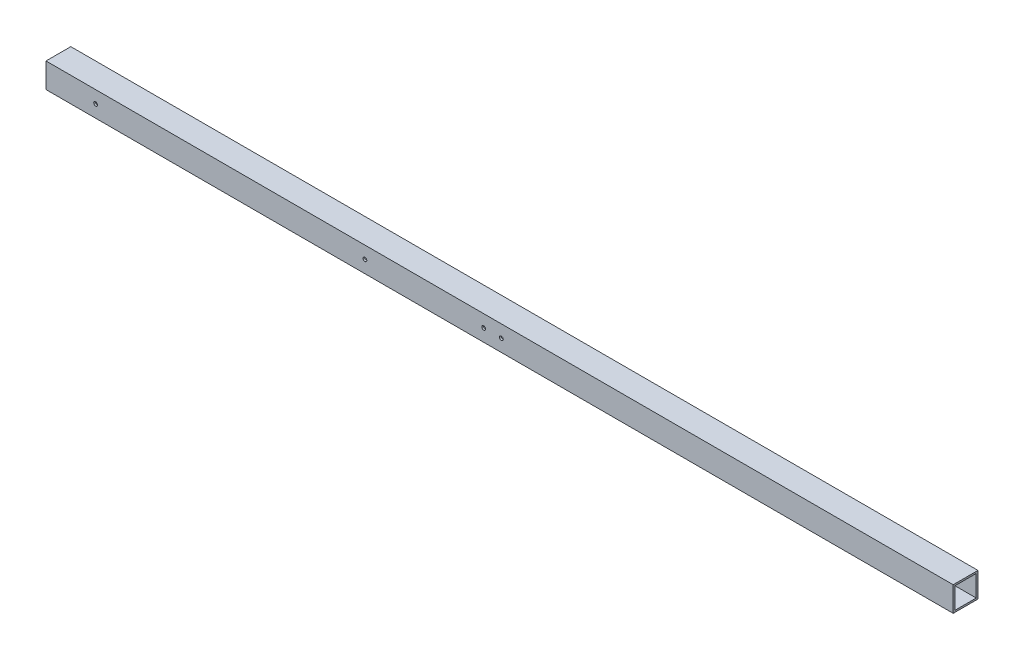
ISO-10303-21;
HEADER;
FILE_DESCRIPTION(('STEP AP214'),'2;1');
FILE_NAME('part.step','',(''),(''),'','','');
FILE_SCHEMA(('AUTOMOTIVE_DESIGN { 1 0 10303 214 1 1 1 1 }'));
ENDSEC;
DATA;
#1=APPLICATION_CONTEXT('core data for automotive mechanical design processes');
#2=APPLICATION_PROTOCOL_DEFINITION('international standard','automotive_design',2000,#1);
#3=PRODUCT_CONTEXT('',#1,'mechanical');
#4=PRODUCT('Part','Part','',(#3));
#5=PRODUCT_RELATED_PRODUCT_CATEGORY('part','',(#4));
#6=PRODUCT_DEFINITION_FORMATION('','',#4);
#7=PRODUCT_DEFINITION_CONTEXT('part definition',#1,'design');
#8=PRODUCT_DEFINITION('design','',#6,#7);
#9=PRODUCT_DEFINITION_SHAPE('','',#8);
#10=(LENGTH_UNIT() NAMED_UNIT(*) SI_UNIT(.MILLI.,.METRE.));
#11=(NAMED_UNIT(*) PLANE_ANGLE_UNIT() SI_UNIT($,.RADIAN.));
#12=(NAMED_UNIT(*) SI_UNIT($,.STERADIAN.) SOLID_ANGLE_UNIT());
#13=UNCERTAINTY_MEASURE_WITH_UNIT(LENGTH_MEASURE(1.E-05),#10,'distance_accuracy_value','');
#14=(GEOMETRIC_REPRESENTATION_CONTEXT(3) GLOBAL_UNCERTAINTY_ASSIGNED_CONTEXT((#13)) GLOBAL_UNIT_ASSIGNED_CONTEXT((#10,
#11,#12)) REPRESENTATION_CONTEXT('',''));
#15=CARTESIAN_POINT('',(0.,0.,0.));
#16=DIRECTION('',(0.,0.,1.));
#17=DIRECTION('',(1.,0.,0.));
#18=AXIS2_PLACEMENT_3D('',#15,#16,#17);
#19=CARTESIAN_POINT('',(1625.6,0.,0.));
#20=DIRECTION('',(-1.,0.,0.));
#21=DIRECTION('',(0.,0.,1.));
#22=AXIS2_PLACEMENT_3D('',#19,#20,#21);
#23=PLANE('',#22);
#24=DIRECTION('',(0.,-1.,0.));
#25=VECTOR('',#24,1.);
#26=CARTESIAN_POINT('',(1625.6,0.,0.));
#27=LINE('',#26,#25);
#28=CARTESIAN_POINT('',(1625.6,44.45,0.));
#29=VERTEX_POINT('',#28);
#30=CARTESIAN_POINT('',(1625.6,0.,0.));
#31=VERTEX_POINT('',#30);
#32=EDGE_CURVE('E142',#29,#31,#27,.T.);
#33=ORIENTED_EDGE('',*,*,#32,.T.);
#34=DIRECTION('',(0.,0.,-1.));
#35=VECTOR('',#34,1.);
#36=CARTESIAN_POINT('',(1625.6,0.,0.));
#37=LINE('',#36,#35);
#38=CARTESIAN_POINT('',(1625.6,0.,-44.45));
#39=VERTEX_POINT('',#38);
#40=EDGE_CURVE('E145',#31,#39,#37,.T.);
#41=ORIENTED_EDGE('',*,*,#40,.T.);
#42=DIRECTION('',(0.,1.,0.));
#43=VECTOR('',#42,1.);
#44=CARTESIAN_POINT('',(1625.6,0.,-44.45));
#45=LINE('',#44,#43);
#46=CARTESIAN_POINT('',(1625.6,44.45,-44.45));
#47=VERTEX_POINT('',#46);
#48=EDGE_CURVE('E148',#39,#47,#45,.T.);
#49=ORIENTED_EDGE('',*,*,#48,.T.);
#50=DIRECTION('',(0.,0.,1.));
#51=VECTOR('',#50,1.);
#52=CARTESIAN_POINT('',(1625.6,44.45,0.));
#53=LINE('',#52,#51);
#54=EDGE_CURVE('E150',#47,#29,#53,.T.);
#55=ORIENTED_EDGE('',*,*,#54,.T.);
#56=EDGE_LOOP('',(#33,#41,#49,#55));
#57=FACE_BOUND('',#56,.T.);
#58=DIRECTION('',(0.,-1.,0.));
#59=VECTOR('',#58,1.);
#60=CARTESIAN_POINT('',(1625.6,41.275,-3.175));
#61=LINE('',#60,#59);
#62=CARTESIAN_POINT('',(1625.6,41.275,-3.175));
#63=VERTEX_POINT('',#62);
#64=CARTESIAN_POINT('',(1625.6,3.175,-3.175));
#65=VERTEX_POINT('',#64);
#66=EDGE_CURVE('E104',#63,#65,#61,.T.);
#67=ORIENTED_EDGE('',*,*,#66,.F.);
#68=DIRECTION('',(0.,0.,1.));
#69=VECTOR('',#68,1.);
#70=CARTESIAN_POINT('',(1625.6,41.275,-3.175));
#71=LINE('',#70,#69);
#72=CARTESIAN_POINT('',(1625.6,41.275,-41.275));
#73=VERTEX_POINT('',#72);
#74=EDGE_CURVE('E126',#73,#63,#71,.T.);
#75=ORIENTED_EDGE('',*,*,#74,.F.);
#76=DIRECTION('',(0.,1.,0.));
#77=VECTOR('',#76,1.);
#78=CARTESIAN_POINT('',(1625.6,41.275,-41.275));
#79=LINE('',#78,#77);
#80=CARTESIAN_POINT('',(1625.6,3.175,-41.275));
#81=VERTEX_POINT('',#80);
#82=EDGE_CURVE('E124',#81,#73,#79,.T.);
#83=ORIENTED_EDGE('',*,*,#82,.F.);
#84=DIRECTION('',(0.,0.,-1.));
#85=VECTOR('',#84,1.);
#86=CARTESIAN_POINT('',(1625.6,3.175,-3.175));
#87=LINE('',#86,#85);
#88=EDGE_CURVE('E112',#65,#81,#87,.T.);
#89=ORIENTED_EDGE('',*,*,#88,.F.);
#90=EDGE_LOOP('',(#67,#75,#83,#89));
#91=FACE_BOUND('',#90,.T.);
#92=ADVANCED_FACE('F37',(#57,#91),#23,.F.);
#93=CARTESIAN_POINT('',(0.,0.,0.));
#94=DIRECTION('',(-1.,0.,0.));
#95=DIRECTION('',(0.,0.,1.));
#96=AXIS2_PLACEMENT_3D('',#93,#94,#95);
#97=PLANE('',#96);
#98=DIRECTION('',(0.,-1.,0.));
#99=VECTOR('',#98,1.);
#100=CARTESIAN_POINT('',(0.,0.,0.));
#101=LINE('',#100,#99);
#102=CARTESIAN_POINT('',(0.,44.45,0.));
#103=VERTEX_POINT('',#102);
#104=CARTESIAN_POINT('',(0.,0.,0.));
#105=VERTEX_POINT('',#104);
#106=EDGE_CURVE('E120',#103,#105,#101,.T.);
#107=ORIENTED_EDGE('',*,*,#106,.F.);
#108=DIRECTION('',(0.,0.,1.));
#109=VECTOR('',#108,1.);
#110=CARTESIAN_POINT('',(0.,44.45,0.));
#111=LINE('',#110,#109);
#112=CARTESIAN_POINT('',(0.,44.45,-44.45));
#113=VERTEX_POINT('',#112);
#114=EDGE_CURVE('E146',#113,#103,#111,.T.);
#115=ORIENTED_EDGE('',*,*,#114,.F.);
#116=DIRECTION('',(0.,1.,0.));
#117=VECTOR('',#116,1.);
#118=CARTESIAN_POINT('',(0.,0.,-44.45));
#119=LINE('',#118,#117);
#120=CARTESIAN_POINT('',(0.,0.,-44.45));
#121=VERTEX_POINT('',#120);
#122=EDGE_CURVE('E157',#121,#113,#119,.T.);
#123=ORIENTED_EDGE('',*,*,#122,.F.);
#124=DIRECTION('',(0.,0.,-1.));
#125=VECTOR('',#124,1.);
#126=CARTESIAN_POINT('',(0.,0.,0.));
#127=LINE('',#126,#125);
#128=EDGE_CURVE('E155',#105,#121,#127,.T.);
#129=ORIENTED_EDGE('',*,*,#128,.F.);
#130=EDGE_LOOP('',(#107,#115,#123,#129));
#131=FACE_BOUND('',#130,.T.);
#132=DIRECTION('',(0.,0.,1.));
#133=VECTOR('',#132,1.);
#134=CARTESIAN_POINT('',(0.,41.275,-3.175));
#135=LINE('',#134,#133);
#136=CARTESIAN_POINT('',(0.,41.275,-41.275));
#137=VERTEX_POINT('',#136);
#138=CARTESIAN_POINT('',(0.,41.275,-3.175));
#139=VERTEX_POINT('',#138);
#140=EDGE_CURVE('E113',#137,#139,#135,.T.);
#141=ORIENTED_EDGE('',*,*,#140,.T.);
#142=DIRECTION('',(0.,-1.,0.));
#143=VECTOR('',#142,1.);
#144=CARTESIAN_POINT('',(0.,41.275,-3.175));
#145=LINE('',#144,#143);
#146=CARTESIAN_POINT('',(0.,3.175,-3.175));
#147=VERTEX_POINT('',#146);
#148=EDGE_CURVE('E62',#139,#147,#145,.T.);
#149=ORIENTED_EDGE('',*,*,#148,.T.);
#150=DIRECTION('',(0.,0.,-1.));
#151=VECTOR('',#150,1.);
#152=CARTESIAN_POINT('',(0.,3.175,-3.175));
#153=LINE('',#152,#151);
#154=CARTESIAN_POINT('',(0.,3.175,-41.275));
#155=VERTEX_POINT('',#154);
#156=EDGE_CURVE('E119',#147,#155,#153,.T.);
#157=ORIENTED_EDGE('',*,*,#156,.T.);
#158=DIRECTION('',(0.,1.,0.));
#159=VECTOR('',#158,1.);
#160=CARTESIAN_POINT('',(0.,41.275,-41.275));
#161=LINE('',#160,#159);
#162=EDGE_CURVE('E134',#155,#137,#161,.T.);
#163=ORIENTED_EDGE('',*,*,#162,.T.);
#164=EDGE_LOOP('',(#141,#149,#157,#163));
#165=FACE_BOUND('',#164,.T.);
#166=ADVANCED_FACE('F209',(#131,#165),#97,.T.);
#167=CARTESIAN_POINT('',(1625.6,0.,0.));
#168=DIRECTION('',(0.,0.,-1.));
#169=DIRECTION('',(-1.,0.,0.));
#170=AXIS2_PLACEMENT_3D('',#167,#168,#169);
#171=PLANE('',#170);
#172=CARTESIAN_POINT('',(88.8999999999999,22.225,0.));
#173=DIRECTION('',(0.,0.,1.));
#174=DIRECTION('',(1.,0.,0.));
#175=AXIS2_PLACEMENT_3D('',#172,#173,#174);
#176=CIRCLE('',#175,3.37343749999999);
#177=CARTESIAN_POINT('',(92.2734374999999,22.225,0.));
#178=VERTEX_POINT('',#177);
#179=EDGE_CURVE('E263',#178,#178,#176,.T.);
#180=ORIENTED_EDGE('',*,*,#179,.F.);
#181=EDGE_LOOP('',(#180));
#182=FACE_BOUND('',#181,.T.);
#183=CARTESIAN_POINT('',(571.5,22.225,0.));
#184=DIRECTION('',(0.,0.,1.));
#185=DIRECTION('',(1.,0.,0.));
#186=AXIS2_PLACEMENT_3D('',#183,#184,#185);
#187=CIRCLE('',#186,3.37343749999992);
#188=CARTESIAN_POINT('',(574.8734375,22.225,0.));
#189=VERTEX_POINT('',#188);
#190=EDGE_CURVE('E267',#189,#189,#187,.T.);
#191=ORIENTED_EDGE('',*,*,#190,.F.);
#192=EDGE_LOOP('',(#191));
#193=FACE_BOUND('',#192,.T.);
#194=CARTESIAN_POINT('',(815.975,22.225,0.));
#195=DIRECTION('',(0.,0.,1.));
#196=DIRECTION('',(1.,0.,0.));
#197=AXIS2_PLACEMENT_3D('',#194,#195,#196);
#198=CIRCLE('',#197,3.37343749999992);
#199=CARTESIAN_POINT('',(819.3484375,22.225,0.));
#200=VERTEX_POINT('',#199);
#201=EDGE_CURVE('E271',#200,#200,#198,.T.);
#202=ORIENTED_EDGE('',*,*,#201,.F.);
#203=EDGE_LOOP('',(#202));
#204=FACE_BOUND('',#203,.T.);
#205=CARTESIAN_POINT('',(784.225,22.225,0.));
#206=DIRECTION('',(0.,0.,1.));
#207=DIRECTION('',(1.,0.,0.));
#208=AXIS2_PLACEMENT_3D('',#205,#206,#207);
#209=CIRCLE('',#208,3.37343749999992);
#210=CARTESIAN_POINT('',(787.5984375,22.225,0.));
#211=VERTEX_POINT('',#210);
#212=EDGE_CURVE('E274',#211,#211,#209,.T.);
#213=ORIENTED_EDGE('',*,*,#212,.F.);
#214=EDGE_LOOP('',(#213));
#215=FACE_BOUND('',#214,.T.);
#216=ORIENTED_EDGE('',*,*,#106,.T.);
#217=DIRECTION('',(-1.,0.,0.));
#218=VECTOR('',#217,1.);
#219=CARTESIAN_POINT('',(1625.6,0.,0.));
#220=LINE('',#219,#218);
#221=EDGE_CURVE('E11',#31,#105,#220,.T.);
#222=ORIENTED_EDGE('',*,*,#221,.F.);
#223=ORIENTED_EDGE('',*,*,#32,.F.);
#224=DIRECTION('',(-1.,0.,0.));
#225=VECTOR('',#224,1.);
#226=CARTESIAN_POINT('',(1625.6,44.45,0.));
#227=LINE('',#226,#225);
#228=EDGE_CURVE('E152',#29,#103,#227,.T.);
#229=ORIENTED_EDGE('',*,*,#228,.T.);
#230=EDGE_LOOP('',(#216,#222,#223,#229));
#231=FACE_BOUND('',#230,.T.);
#232=ADVANCED_FACE('F39',(#182,#193,#204,#215,#231),#171,.F.);
#233=CARTESIAN_POINT('',(1625.6,0.,0.));
#234=DIRECTION('',(0.,1.,0.));
#235=DIRECTION('',(0.,0.,1.));
#236=AXIS2_PLACEMENT_3D('',#233,#234,#235);
#237=PLANE('',#236);
#238=ORIENTED_EDGE('',*,*,#128,.T.);
#239=DIRECTION('',(-1.,0.,0.));
#240=VECTOR('',#239,1.);
#241=CARTESIAN_POINT('',(1625.6,0.,-44.45));
#242=LINE('',#241,#240);
#243=EDGE_CURVE('E46',#39,#121,#242,.T.);
#244=ORIENTED_EDGE('',*,*,#243,.F.);
#245=ORIENTED_EDGE('',*,*,#40,.F.);
#246=ORIENTED_EDGE('',*,*,#221,.T.);
#247=EDGE_LOOP('',(#238,#244,#245,#246));
#248=FACE_BOUND('',#247,.T.);
#249=ADVANCED_FACE('F239',(#248),#237,.F.);
#250=CARTESIAN_POINT('',(1625.6,0.,-44.45));
#251=DIRECTION('',(0.,0.,1.));
#252=DIRECTION('',(1.,0.,0.));
#253=AXIS2_PLACEMENT_3D('',#250,#251,#252);
#254=PLANE('',#253);
#255=CARTESIAN_POINT('',(88.8999999999999,22.225,-44.45));
#256=DIRECTION('',(0.,0.,1.));
#257=DIRECTION('',(1.,0.,0.));
#258=AXIS2_PLACEMENT_3D('',#255,#256,#257);
#259=CIRCLE('',#258,3.37343749999999);
#260=CARTESIAN_POINT('',(92.2734374999999,22.225,-44.45));
#261=VERTEX_POINT('',#260);
#262=EDGE_CURVE('E283',#261,#261,#259,.T.);
#263=ORIENTED_EDGE('',*,*,#262,.T.);
#264=EDGE_LOOP('',(#263));
#265=FACE_BOUND('',#264,.T.);
#266=CARTESIAN_POINT('',(571.5,22.225,-44.45));
#267=DIRECTION('',(0.,0.,1.));
#268=DIRECTION('',(1.,0.,0.));
#269=AXIS2_PLACEMENT_3D('',#266,#267,#268);
#270=CIRCLE('',#269,3.37343749999992);
#271=CARTESIAN_POINT('',(574.8734375,22.225,-44.45));
#272=VERTEX_POINT('',#271);
#273=EDGE_CURVE('E287',#272,#272,#270,.T.);
#274=ORIENTED_EDGE('',*,*,#273,.T.);
#275=EDGE_LOOP('',(#274));
#276=FACE_BOUND('',#275,.T.);
#277=CARTESIAN_POINT('',(815.975,22.225,-44.45));
#278=DIRECTION('',(0.,0.,1.));
#279=DIRECTION('',(1.,0.,0.));
#280=AXIS2_PLACEMENT_3D('',#277,#278,#279);
#281=CIRCLE('',#280,3.37343749999992);
#282=CARTESIAN_POINT('',(819.3484375,22.225,-44.45));
#283=VERTEX_POINT('',#282);
#284=EDGE_CURVE('E276',#283,#283,#281,.T.);
#285=ORIENTED_EDGE('',*,*,#284,.T.);
#286=EDGE_LOOP('',(#285));
#287=FACE_BOUND('',#286,.T.);
#288=CARTESIAN_POINT('',(784.225,22.225,-44.45));
#289=DIRECTION('',(0.,0.,1.));
#290=DIRECTION('',(1.,0.,0.));
#291=AXIS2_PLACEMENT_3D('',#288,#289,#290);
#292=CIRCLE('',#291,3.37343749999992);
#293=CARTESIAN_POINT('',(787.5984375,22.225,-44.45));
#294=VERTEX_POINT('',#293);
#295=EDGE_CURVE('E171',#294,#294,#292,.T.);
#296=ORIENTED_EDGE('',*,*,#295,.T.);
#297=EDGE_LOOP('',(#296));
#298=FACE_BOUND('',#297,.T.);
#299=ORIENTED_EDGE('',*,*,#122,.T.);
#300=DIRECTION('',(-1.,0.,0.));
#301=VECTOR('',#300,1.);
#302=CARTESIAN_POINT('',(1625.6,44.45,-44.45));
#303=LINE('',#302,#301);
#304=EDGE_CURVE('E162',#47,#113,#303,.T.);
#305=ORIENTED_EDGE('',*,*,#304,.F.);
#306=ORIENTED_EDGE('',*,*,#48,.F.);
#307=ORIENTED_EDGE('',*,*,#243,.T.);
#308=EDGE_LOOP('',(#299,#305,#306,#307));
#309=FACE_BOUND('',#308,.T.);
#310=ADVANCED_FACE('F236',(#265,#276,#287,#298,#309),#254,.F.);
#311=CARTESIAN_POINT('',(1625.6,44.45,0.));
#312=DIRECTION('',(0.,-1.,0.));
#313=DIRECTION('',(0.,0.,-1.));
#314=AXIS2_PLACEMENT_3D('',#311,#312,#313);
#315=PLANE('',#314);
#316=ORIENTED_EDGE('',*,*,#114,.T.);
#317=ORIENTED_EDGE('',*,*,#228,.F.);
#318=ORIENTED_EDGE('',*,*,#54,.F.);
#319=ORIENTED_EDGE('',*,*,#304,.T.);
#320=EDGE_LOOP('',(#316,#317,#318,#319));
#321=FACE_BOUND('',#320,.T.);
#322=ADVANCED_FACE('F233',(#321),#315,.F.);
#323=CARTESIAN_POINT('',(1625.6,41.275,-3.175));
#324=DIRECTION('',(0.,0.,-1.));
#325=DIRECTION('',(0.,1.,0.));
#326=AXIS2_PLACEMENT_3D('',#323,#324,#325);
#327=PLANE('',#326);
#328=CARTESIAN_POINT('',(88.8999999999999,22.225,-3.175));
#329=DIRECTION('',(0.,0.,-1.));
#330=DIRECTION('',(0.,1.,0.));
#331=AXIS2_PLACEMENT_3D('',#328,#329,#330);
#332=CIRCLE('',#331,3.37343749999999);
#333=CARTESIAN_POINT('',(88.8999999999999,25.5984375,-3.175));
#334=VERTEX_POINT('',#333);
#335=EDGE_CURVE('E132',#334,#334,#332,.T.);
#336=ORIENTED_EDGE('',*,*,#335,.F.);
#337=EDGE_LOOP('',(#336));
#338=FACE_BOUND('',#337,.T.);
#339=CARTESIAN_POINT('',(571.5,22.225,-3.175));
#340=DIRECTION('',(0.,0.,-1.));
#341=DIRECTION('',(0.,1.,0.));
#342=AXIS2_PLACEMENT_3D('',#339,#340,#341);
#343=CIRCLE('',#342,3.37343749999992);
#344=CARTESIAN_POINT('',(571.5,25.5984374999999,-3.175));
#345=VERTEX_POINT('',#344);
#346=EDGE_CURVE('E177',#345,#345,#343,.T.);
#347=ORIENTED_EDGE('',*,*,#346,.F.);
#348=EDGE_LOOP('',(#347));
#349=FACE_BOUND('',#348,.T.);
#350=CARTESIAN_POINT('',(815.975,22.225,-3.175));
#351=DIRECTION('',(0.,0.,-1.));
#352=DIRECTION('',(0.,1.,0.));
#353=AXIS2_PLACEMENT_3D('',#350,#351,#352);
#354=CIRCLE('',#353,3.37343749999992);
#355=CARTESIAN_POINT('',(815.975,25.5984374999999,-3.175));
#356=VERTEX_POINT('',#355);
#357=EDGE_CURVE('E174',#356,#356,#354,.T.);
#358=ORIENTED_EDGE('',*,*,#357,.F.);
#359=EDGE_LOOP('',(#358));
#360=FACE_BOUND('',#359,.T.);
#361=CARTESIAN_POINT('',(784.225,22.225,-3.175));
#362=DIRECTION('',(0.,0.,-1.));
#363=DIRECTION('',(0.,1.,0.));
#364=AXIS2_PLACEMENT_3D('',#361,#362,#363);
#365=CIRCLE('',#364,3.37343749999992);
#366=CARTESIAN_POINT('',(784.225,25.5984374999999,-3.175));
#367=VERTEX_POINT('',#366);
#368=EDGE_CURVE('E170',#367,#367,#365,.T.);
#369=ORIENTED_EDGE('',*,*,#368,.F.);
#370=EDGE_LOOP('',(#369));
#371=FACE_BOUND('',#370,.T.);
#372=ORIENTED_EDGE('',*,*,#148,.F.);
#373=DIRECTION('',(-1.,0.,0.));
#374=VECTOR('',#373,1.);
#375=CARTESIAN_POINT('',(1625.6,41.275,-3.175));
#376=LINE('',#375,#374);
#377=EDGE_CURVE('E108',#63,#139,#376,.T.);
#378=ORIENTED_EDGE('',*,*,#377,.F.);
#379=ORIENTED_EDGE('',*,*,#66,.T.);
#380=DIRECTION('',(-1.,0.,0.));
#381=VECTOR('',#380,1.);
#382=CARTESIAN_POINT('',(1625.6,3.175,-3.175));
#383=LINE('',#382,#381);
#384=EDGE_CURVE('E107',#65,#147,#383,.T.);
#385=ORIENTED_EDGE('',*,*,#384,.T.);
#386=EDGE_LOOP('',(#372,#378,#379,#385));
#387=FACE_BOUND('',#386,.T.);
#388=ADVANCED_FACE('F106',(#338,#349,#360,#371,#387),#327,.T.);
#389=CARTESIAN_POINT('',(1625.6,3.175,-3.175));
#390=DIRECTION('',(0.,1.,0.));
#391=DIRECTION('',(0.,0.,1.));
#392=AXIS2_PLACEMENT_3D('',#389,#390,#391);
#393=PLANE('',#392);
#394=ORIENTED_EDGE('',*,*,#156,.F.);
#395=ORIENTED_EDGE('',*,*,#384,.F.);
#396=ORIENTED_EDGE('',*,*,#88,.T.);
#397=DIRECTION('',(-1.,0.,0.));
#398=VECTOR('',#397,1.);
#399=CARTESIAN_POINT('',(1625.6,3.175,-41.275));
#400=LINE('',#399,#398);
#401=EDGE_CURVE('E121',#81,#155,#400,.T.);
#402=ORIENTED_EDGE('',*,*,#401,.T.);
#403=EDGE_LOOP('',(#394,#395,#396,#402));
#404=FACE_BOUND('',#403,.T.);
#405=ADVANCED_FACE('F116',(#404),#393,.T.);
#406=CARTESIAN_POINT('',(1625.6,41.275,-41.275));
#407=DIRECTION('',(0.,0.,1.));
#408=DIRECTION('',(0.,-1.,0.));
#409=AXIS2_PLACEMENT_3D('',#406,#407,#408);
#410=PLANE('',#409);
#411=CARTESIAN_POINT('',(88.8999999999999,22.225,-41.275));
#412=DIRECTION('',(0.,0.,1.));
#413=DIRECTION('',(0.,-1.,0.));
#414=AXIS2_PLACEMENT_3D('',#411,#412,#413);
#415=CIRCLE('',#414,3.37343749999999);
#416=CARTESIAN_POINT('',(88.8999999999999,18.8515625,-41.275));
#417=VERTEX_POINT('',#416);
#418=EDGE_CURVE('E41',#417,#417,#415,.T.);
#419=ORIENTED_EDGE('',*,*,#418,.F.);
#420=EDGE_LOOP('',(#419));
#421=FACE_BOUND('',#420,.T.);
#422=CARTESIAN_POINT('',(571.5,22.225,-41.275));
#423=DIRECTION('',(0.,0.,1.));
#424=DIRECTION('',(0.,-1.,0.));
#425=AXIS2_PLACEMENT_3D('',#422,#423,#424);
#426=CIRCLE('',#425,3.37343749999992);
#427=CARTESIAN_POINT('',(571.5,18.8515625000001,-41.275));
#428=VERTEX_POINT('',#427);
#429=EDGE_CURVE('E175',#428,#428,#426,.T.);
#430=ORIENTED_EDGE('',*,*,#429,.F.);
#431=EDGE_LOOP('',(#430));
#432=FACE_BOUND('',#431,.T.);
#433=CARTESIAN_POINT('',(815.975,22.225,-41.275));
#434=DIRECTION('',(0.,0.,1.));
#435=DIRECTION('',(0.,-1.,0.));
#436=AXIS2_PLACEMENT_3D('',#433,#434,#435);
#437=CIRCLE('',#436,3.37343749999992);
#438=CARTESIAN_POINT('',(815.975,18.8515625000001,-41.275));
#439=VERTEX_POINT('',#438);
#440=EDGE_CURVE('E172',#439,#439,#437,.T.);
#441=ORIENTED_EDGE('',*,*,#440,.F.);
#442=EDGE_LOOP('',(#441));
#443=FACE_BOUND('',#442,.T.);
#444=CARTESIAN_POINT('',(784.225,22.225,-41.275));
#445=DIRECTION('',(0.,0.,1.));
#446=DIRECTION('',(0.,-1.,0.));
#447=AXIS2_PLACEMENT_3D('',#444,#445,#446);
#448=CIRCLE('',#447,3.37343749999992);
#449=CARTESIAN_POINT('',(784.225,18.8515625000001,-41.275));
#450=VERTEX_POINT('',#449);
#451=EDGE_CURVE('E167',#450,#450,#448,.T.);
#452=ORIENTED_EDGE('',*,*,#451,.F.);
#453=EDGE_LOOP('',(#452));
#454=FACE_BOUND('',#453,.T.);
#455=ORIENTED_EDGE('',*,*,#162,.F.);
#456=ORIENTED_EDGE('',*,*,#401,.F.);
#457=ORIENTED_EDGE('',*,*,#82,.T.);
#458=DIRECTION('',(-1.,0.,0.));
#459=VECTOR('',#458,1.);
#460=CARTESIAN_POINT('',(1625.6,41.275,-41.275));
#461=LINE('',#460,#459);
#462=EDGE_CURVE('E54',#73,#137,#461,.T.);
#463=ORIENTED_EDGE('',*,*,#462,.T.);
#464=EDGE_LOOP('',(#455,#456,#457,#463));
#465=FACE_BOUND('',#464,.T.);
#466=ADVANCED_FACE('F197',(#421,#432,#443,#454,#465),#410,.T.);
#467=CARTESIAN_POINT('',(1625.6,41.275,-3.175));
#468=DIRECTION('',(0.,-1.,0.));
#469=DIRECTION('',(0.,0.,-1.));
#470=AXIS2_PLACEMENT_3D('',#467,#468,#469);
#471=PLANE('',#470);
#472=ORIENTED_EDGE('',*,*,#140,.F.);
#473=ORIENTED_EDGE('',*,*,#462,.F.);
#474=ORIENTED_EDGE('',*,*,#74,.T.);
#475=ORIENTED_EDGE('',*,*,#377,.T.);
#476=EDGE_LOOP('',(#472,#473,#474,#475));
#477=FACE_BOUND('',#476,.T.);
#478=ADVANCED_FACE('F200',(#477),#471,.T.);
#479=CARTESIAN_POINT('',(784.225,22.225,-44.45));
#480=DIRECTION('',(0.,0.,1.));
#481=DIRECTION('',(1.,0.,0.));
#482=AXIS2_PLACEMENT_3D('',#479,#480,#481);
#483=CYLINDRICAL_SURFACE('',#482,3.37343749999992);
#484=ORIENTED_EDGE('',*,*,#451,.T.);
#485=EDGE_LOOP('',(#484));
#486=FACE_BOUND('',#485,.T.);
#487=ORIENTED_EDGE('',*,*,#295,.F.);
#488=EDGE_LOOP('',(#487));
#489=FACE_BOUND('',#488,.T.);
#490=ADVANCED_FACE('F211',(#486,#489),#483,.F.);
#491=CARTESIAN_POINT('',(815.975,22.225,-44.45));
#492=DIRECTION('',(0.,0.,1.));
#493=DIRECTION('',(1.,0.,0.));
#494=AXIS2_PLACEMENT_3D('',#491,#492,#493);
#495=CYLINDRICAL_SURFACE('',#494,3.37343749999992);
#496=ORIENTED_EDGE('',*,*,#440,.T.);
#497=EDGE_LOOP('',(#496));
#498=FACE_BOUND('',#497,.T.);
#499=ORIENTED_EDGE('',*,*,#284,.F.);
#500=EDGE_LOOP('',(#499));
#501=FACE_BOUND('',#500,.T.);
#502=ADVANCED_FACE('F218',(#498,#501),#495,.F.);
#503=CARTESIAN_POINT('',(571.5,22.225,-44.45));
#504=DIRECTION('',(0.,0.,1.));
#505=DIRECTION('',(1.,0.,0.));
#506=AXIS2_PLACEMENT_3D('',#503,#504,#505);
#507=CYLINDRICAL_SURFACE('',#506,3.37343749999992);
#508=ORIENTED_EDGE('',*,*,#429,.T.);
#509=EDGE_LOOP('',(#508));
#510=FACE_BOUND('',#509,.T.);
#511=ORIENTED_EDGE('',*,*,#273,.F.);
#512=EDGE_LOOP('',(#511));
#513=FACE_BOUND('',#512,.T.);
#514=ADVANCED_FACE('F302',(#510,#513),#507,.F.);
#515=CARTESIAN_POINT('',(88.8999999999999,22.225,-44.45));
#516=DIRECTION('',(0.,0.,1.));
#517=DIRECTION('',(1.,0.,0.));
#518=AXIS2_PLACEMENT_3D('',#515,#516,#517);
#519=CYLINDRICAL_SURFACE('',#518,3.37343749999999);
#520=ORIENTED_EDGE('',*,*,#418,.T.);
#521=EDGE_LOOP('',(#520));
#522=FACE_BOUND('',#521,.T.);
#523=ORIENTED_EDGE('',*,*,#262,.F.);
#524=EDGE_LOOP('',(#523));
#525=FACE_BOUND('',#524,.T.);
#526=ADVANCED_FACE('F194',(#522,#525),#519,.F.);
#527=ORIENTED_EDGE('',*,*,#368,.T.);
#528=EDGE_LOOP('',(#527));
#529=FACE_BOUND('',#528,.T.);
#530=ORIENTED_EDGE('',*,*,#212,.T.);
#531=EDGE_LOOP('',(#530));
#532=FACE_BOUND('',#531,.T.);
#533=ADVANCED_FACE('F221',(#529,#532),#483,.F.);
#534=ORIENTED_EDGE('',*,*,#357,.T.);
#535=EDGE_LOOP('',(#534));
#536=FACE_BOUND('',#535,.T.);
#537=ORIENTED_EDGE('',*,*,#201,.T.);
#538=EDGE_LOOP('',(#537));
#539=FACE_BOUND('',#538,.T.);
#540=ADVANCED_FACE('F291',(#536,#539),#495,.F.);
#541=ORIENTED_EDGE('',*,*,#346,.T.);
#542=EDGE_LOOP('',(#541));
#543=FACE_BOUND('',#542,.T.);
#544=ORIENTED_EDGE('',*,*,#190,.T.);
#545=EDGE_LOOP('',(#544));
#546=FACE_BOUND('',#545,.T.);
#547=ADVANCED_FACE('F293',(#543,#546),#507,.F.);
#548=ORIENTED_EDGE('',*,*,#335,.T.);
#549=EDGE_LOOP('',(#548));
#550=FACE_BOUND('',#549,.T.);
#551=ORIENTED_EDGE('',*,*,#179,.T.);
#552=EDGE_LOOP('',(#551));
#553=FACE_BOUND('',#552,.T.);
#554=ADVANCED_FACE('F299',(#550,#553),#519,.F.);
#555=CLOSED_SHELL('',(#92,#166,#232,#249,#310,#322,#388,#405,#466,#478,#490,#502,#514,#526,#533,
#540,#547,#554));
#556=MANIFOLD_SOLID_BREP('B2',#555);
#557=ADVANCED_BREP_SHAPE_REPRESENTATION('',(#18,#556),#14);
#558=SHAPE_DEFINITION_REPRESENTATION(#9,#557);
ENDSEC;
END-ISO-10303-21;
